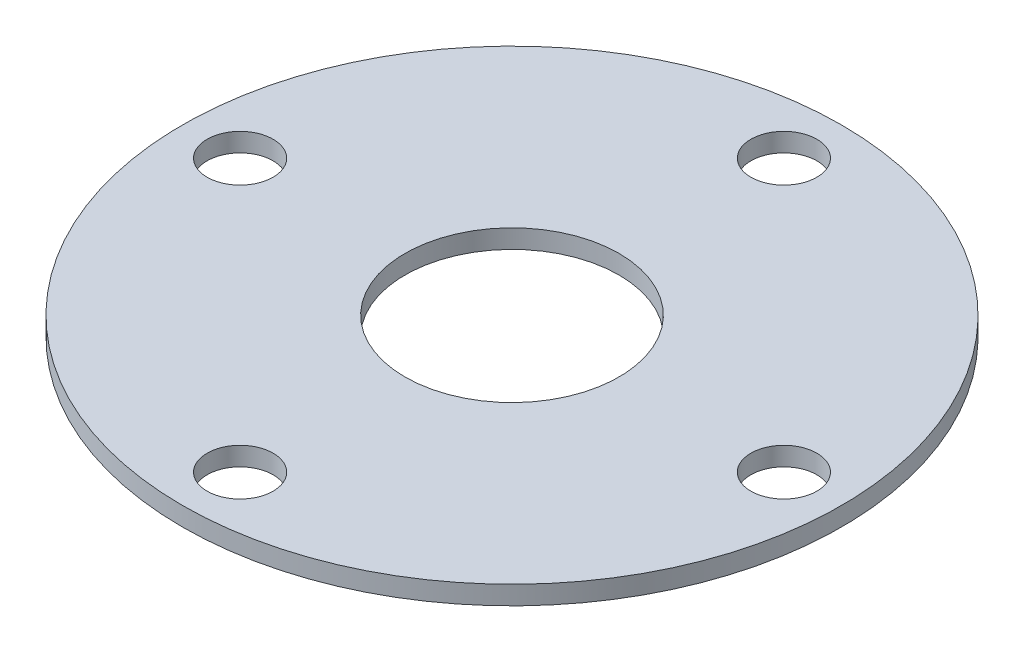
ISO-10303-21;
HEADER;
FILE_DESCRIPTION(('STEP AP214'),'2;1');
FILE_NAME('part.step','',(''),(''),'','','');
FILE_SCHEMA(('AUTOMOTIVE_DESIGN { 1 0 10303 214 1 1 1 1 }'));
ENDSEC;
DATA;
#1=APPLICATION_CONTEXT('core data for automotive mechanical design processes');
#2=APPLICATION_PROTOCOL_DEFINITION('international standard','automotive_design',2000,#1);
#3=PRODUCT_CONTEXT('',#1,'mechanical');
#4=PRODUCT('Part','Part','',(#3));
#5=PRODUCT_RELATED_PRODUCT_CATEGORY('part','',(#4));
#6=PRODUCT_DEFINITION_FORMATION('','',#4);
#7=PRODUCT_DEFINITION_CONTEXT('part definition',#1,'design');
#8=PRODUCT_DEFINITION('design','',#6,#7);
#9=PRODUCT_DEFINITION_SHAPE('','',#8);
#10=(LENGTH_UNIT() NAMED_UNIT(*) SI_UNIT(.MILLI.,.METRE.));
#11=(NAMED_UNIT(*) PLANE_ANGLE_UNIT() SI_UNIT($,.RADIAN.));
#12=(NAMED_UNIT(*) SI_UNIT($,.STERADIAN.) SOLID_ANGLE_UNIT());
#13=UNCERTAINTY_MEASURE_WITH_UNIT(LENGTH_MEASURE(1.E-05),#10,'distance_accuracy_value','');
#14=(GEOMETRIC_REPRESENTATION_CONTEXT(3) GLOBAL_UNCERTAINTY_ASSIGNED_CONTEXT((#13)) GLOBAL_UNIT_ASSIGNED_CONTEXT((#10,
#11,#12)) REPRESENTATION_CONTEXT('',''));
#15=CARTESIAN_POINT('',(0.,0.,0.));
#16=DIRECTION('',(0.,0.,1.));
#17=DIRECTION('',(1.,0.,0.));
#18=AXIS2_PLACEMENT_3D('',#15,#16,#17);
#19=CARTESIAN_POINT('',(0.,1.8034,0.));
#20=DIRECTION('',(0.,1.,0.));
#21=DIRECTION('',(0.,0.,1.));
#22=AXIS2_PLACEMENT_3D('',#19,#20,#21);
#23=PLANE('',#22);
#24=CARTESIAN_POINT('',(1.82909978638645E-13,1.8034,-26.19375));
#25=DIRECTION('',(0.,1.,0.));
#26=DIRECTION('',(0.,0.,1.));
#27=AXIS2_PLACEMENT_3D('',#24,#25,#26);
#28=CIRCLE('',#27,3.175);
#29=CARTESIAN_POINT('',(1.82909978638645E-13,1.8034,-23.01875));
#30=VERTEX_POINT('',#29);
#31=EDGE_CURVE('E60',#30,#30,#28,.T.);
#32=ORIENTED_EDGE('',*,*,#31,.F.);
#33=EDGE_LOOP('',(#32));
#34=FACE_BOUND('',#33,.T.);
#35=CARTESIAN_POINT('',(0.,1.8034,26.19375));
#36=DIRECTION('',(0.,1.,0.));
#37=DIRECTION('',(0.,0.,1.));
#38=AXIS2_PLACEMENT_3D('',#35,#36,#37);
#39=CIRCLE('',#38,3.175);
#40=CARTESIAN_POINT('',(0.,1.8034,29.36875));
#41=VERTEX_POINT('',#40);
#42=EDGE_CURVE('E48',#41,#41,#39,.T.);
#43=ORIENTED_EDGE('',*,*,#42,.F.);
#44=EDGE_LOOP('',(#43));
#45=FACE_BOUND('',#44,.T.);
#46=CARTESIAN_POINT('',(0.,1.8034,0.));
#47=DIRECTION('',(0.,1.,0.));
#48=DIRECTION('',(0.,0.,1.));
#49=AXIS2_PLACEMENT_3D('',#46,#47,#48);
#50=CIRCLE('',#49,31.75);
#51=CARTESIAN_POINT('',(0.,1.8034,31.75));
#52=VERTEX_POINT('',#51);
#53=EDGE_CURVE('E10',#52,#52,#50,.T.);
#54=ORIENTED_EDGE('',*,*,#53,.T.);
#55=EDGE_LOOP('',(#54));
#56=FACE_BOUND('',#55,.T.);
#57=CARTESIAN_POINT('',(0.,1.8034,0.));
#58=DIRECTION('',(0.,1.,0.));
#59=DIRECTION('',(0.,0.,1.));
#60=AXIS2_PLACEMENT_3D('',#57,#58,#59);
#61=CIRCLE('',#60,10.3124);
#62=CARTESIAN_POINT('',(0.,1.8034,10.3124));
#63=VERTEX_POINT('',#62);
#64=EDGE_CURVE('E43',#63,#63,#61,.T.);
#65=ORIENTED_EDGE('',*,*,#64,.F.);
#66=EDGE_LOOP('',(#65));
#67=FACE_BOUND('',#66,.T.);
#68=CARTESIAN_POINT('',(-26.19375,1.8034,0.));
#69=DIRECTION('',(0.,1.,0.));
#70=DIRECTION('',(0.,0.,1.));
#71=AXIS2_PLACEMENT_3D('',#68,#69,#70);
#72=CIRCLE('',#71,3.175);
#73=CARTESIAN_POINT('',(-26.19375,1.8034,3.17499999999991));
#74=VERTEX_POINT('',#73);
#75=EDGE_CURVE('E54',#74,#74,#72,.T.);
#76=ORIENTED_EDGE('',*,*,#75,.F.);
#77=EDGE_LOOP('',(#76));
#78=FACE_BOUND('',#77,.T.);
#79=CARTESIAN_POINT('',(26.19375,1.8034,2.74364967957967E-13));
#80=DIRECTION('',(0.,1.,0.));
#81=DIRECTION('',(0.,0.,1.));
#82=AXIS2_PLACEMENT_3D('',#79,#80,#81);
#83=CIRCLE('',#82,3.175);
#84=CARTESIAN_POINT('',(26.19375,1.8034,3.17500000000028));
#85=VERTEX_POINT('',#84);
#86=EDGE_CURVE('E66',#85,#85,#83,.T.);
#87=ORIENTED_EDGE('',*,*,#86,.F.);
#88=EDGE_LOOP('',(#87));
#89=FACE_BOUND('',#88,.T.);
#90=ADVANCED_FACE('F32',(#34,#45,#56,#67,#78,#89),#23,.T.);
#91=CARTESIAN_POINT('',(0.,0.,0.));
#92=DIRECTION('',(0.,1.,0.));
#93=DIRECTION('',(0.,0.,1.));
#94=AXIS2_PLACEMENT_3D('',#91,#92,#93);
#95=PLANE('',#94);
#96=CARTESIAN_POINT('',(0.,0.,0.));
#97=DIRECTION('',(0.,1.,0.));
#98=DIRECTION('',(0.,0.,1.));
#99=AXIS2_PLACEMENT_3D('',#96,#97,#98);
#100=CIRCLE('',#99,31.75);
#101=CARTESIAN_POINT('',(0.,0.,31.75));
#102=VERTEX_POINT('',#101);
#103=EDGE_CURVE('E36',#102,#102,#100,.T.);
#104=ORIENTED_EDGE('',*,*,#103,.F.);
#105=EDGE_LOOP('',(#104));
#106=FACE_BOUND('',#105,.T.);
#107=CARTESIAN_POINT('',(0.,0.,0.));
#108=DIRECTION('',(0.,1.,0.));
#109=DIRECTION('',(0.,0.,1.));
#110=AXIS2_PLACEMENT_3D('',#107,#108,#109);
#111=CIRCLE('',#110,10.3124);
#112=CARTESIAN_POINT('',(0.,0.,10.3124));
#113=VERTEX_POINT('',#112);
#114=EDGE_CURVE('E45',#113,#113,#111,.T.);
#115=ORIENTED_EDGE('',*,*,#114,.T.);
#116=EDGE_LOOP('',(#115));
#117=FACE_BOUND('',#116,.T.);
#118=CARTESIAN_POINT('',(0.,0.,26.19375));
#119=DIRECTION('',(0.,1.,0.));
#120=DIRECTION('',(0.,0.,1.));
#121=AXIS2_PLACEMENT_3D('',#118,#119,#120);
#122=CIRCLE('',#121,3.175);
#123=CARTESIAN_POINT('',(0.,0.,29.36875));
#124=VERTEX_POINT('',#123);
#125=EDGE_CURVE('E51',#124,#124,#122,.T.);
#126=ORIENTED_EDGE('',*,*,#125,.T.);
#127=EDGE_LOOP('',(#126));
#128=FACE_BOUND('',#127,.T.);
#129=CARTESIAN_POINT('',(-26.19375,0.,0.));
#130=DIRECTION('',(0.,1.,0.));
#131=DIRECTION('',(0.,0.,1.));
#132=AXIS2_PLACEMENT_3D('',#129,#130,#131);
#133=CIRCLE('',#132,3.175);
#134=CARTESIAN_POINT('',(-26.19375,0.,3.17499999999991));
#135=VERTEX_POINT('',#134);
#136=EDGE_CURVE('E57',#135,#135,#133,.T.);
#137=ORIENTED_EDGE('',*,*,#136,.T.);
#138=EDGE_LOOP('',(#137));
#139=FACE_BOUND('',#138,.T.);
#140=CARTESIAN_POINT('',(1.82909978638645E-13,0.,-26.19375));
#141=DIRECTION('',(0.,1.,0.));
#142=DIRECTION('',(0.,0.,1.));
#143=AXIS2_PLACEMENT_3D('',#140,#141,#142);
#144=CIRCLE('',#143,3.175);
#145=CARTESIAN_POINT('',(1.82909978638645E-13,0.,-23.01875));
#146=VERTEX_POINT('',#145);
#147=EDGE_CURVE('E63',#146,#146,#144,.T.);
#148=ORIENTED_EDGE('',*,*,#147,.T.);
#149=EDGE_LOOP('',(#148));
#150=FACE_BOUND('',#149,.T.);
#151=CARTESIAN_POINT('',(26.19375,0.,2.74364967957967E-13));
#152=DIRECTION('',(0.,1.,0.));
#153=DIRECTION('',(0.,0.,1.));
#154=AXIS2_PLACEMENT_3D('',#151,#152,#153);
#155=CIRCLE('',#154,3.175);
#156=CARTESIAN_POINT('',(26.19375,0.,3.17500000000028));
#157=VERTEX_POINT('',#156);
#158=EDGE_CURVE('E69',#157,#157,#155,.T.);
#159=ORIENTED_EDGE('',*,*,#158,.T.);
#160=EDGE_LOOP('',(#159));
#161=FACE_BOUND('',#160,.T.);
#162=ADVANCED_FACE('F79',(#106,#117,#128,#139,#150,#161),#95,.F.);
#163=CARTESIAN_POINT('',(0.,1.8034,0.));
#164=DIRECTION('',(0.,-1.,0.));
#165=DIRECTION('',(0.,0.,-1.));
#166=AXIS2_PLACEMENT_3D('',#163,#164,#165);
#167=CYLINDRICAL_SURFACE('',#166,31.75);
#168=ORIENTED_EDGE('',*,*,#53,.F.);
#169=EDGE_LOOP('',(#168));
#170=FACE_BOUND('',#169,.T.);
#171=ORIENTED_EDGE('',*,*,#103,.T.);
#172=EDGE_LOOP('',(#171));
#173=FACE_BOUND('',#172,.T.);
#174=ADVANCED_FACE('F34',(#170,#173),#167,.T.);
#175=CARTESIAN_POINT('',(0.,1.8034,0.));
#176=DIRECTION('',(0.,-1.,0.));
#177=DIRECTION('',(0.,0.,-1.));
#178=AXIS2_PLACEMENT_3D('',#175,#176,#177);
#179=CYLINDRICAL_SURFACE('',#178,10.3124);
#180=ORIENTED_EDGE('',*,*,#64,.T.);
#181=EDGE_LOOP('',(#180));
#182=FACE_BOUND('',#181,.T.);
#183=ORIENTED_EDGE('',*,*,#114,.F.);
#184=EDGE_LOOP('',(#183));
#185=FACE_BOUND('',#184,.T.);
#186=ADVANCED_FACE('F89',(#182,#185),#179,.F.);
#187=CARTESIAN_POINT('',(0.,1.8034,26.19375));
#188=DIRECTION('',(0.,-1.,0.));
#189=DIRECTION('',(0.,0.,-1.));
#190=AXIS2_PLACEMENT_3D('',#187,#188,#189);
#191=CYLINDRICAL_SURFACE('',#190,3.175);
#192=ORIENTED_EDGE('',*,*,#42,.T.);
#193=EDGE_LOOP('',(#192));
#194=FACE_BOUND('',#193,.T.);
#195=ORIENTED_EDGE('',*,*,#125,.F.);
#196=EDGE_LOOP('',(#195));
#197=FACE_BOUND('',#196,.T.);
#198=ADVANCED_FACE('F92',(#194,#197),#191,.F.);
#199=CARTESIAN_POINT('',(-26.19375,1.8034,0.));
#200=DIRECTION('',(0.,-1.,0.));
#201=DIRECTION('',(0.,0.,-1.));
#202=AXIS2_PLACEMENT_3D('',#199,#200,#201);
#203=CYLINDRICAL_SURFACE('',#202,3.175);
#204=ORIENTED_EDGE('',*,*,#75,.T.);
#205=EDGE_LOOP('',(#204));
#206=FACE_BOUND('',#205,.T.);
#207=ORIENTED_EDGE('',*,*,#136,.F.);
#208=EDGE_LOOP('',(#207));
#209=FACE_BOUND('',#208,.T.);
#210=ADVANCED_FACE('F96',(#206,#209),#203,.F.);
#211=CARTESIAN_POINT('',(1.82909978638645E-13,1.8034,-26.19375));
#212=DIRECTION('',(0.,-1.,0.));
#213=DIRECTION('',(0.,0.,-1.));
#214=AXIS2_PLACEMENT_3D('',#211,#212,#213);
#215=CYLINDRICAL_SURFACE('',#214,3.175);
#216=ORIENTED_EDGE('',*,*,#31,.T.);
#217=EDGE_LOOP('',(#216));
#218=FACE_BOUND('',#217,.T.);
#219=ORIENTED_EDGE('',*,*,#147,.F.);
#220=EDGE_LOOP('',(#219));
#221=FACE_BOUND('',#220,.T.);
#222=ADVANCED_FACE('F100',(#218,#221),#215,.F.);
#223=CARTESIAN_POINT('',(26.19375,1.8034,2.74364967957967E-13));
#224=DIRECTION('',(0.,-1.,0.));
#225=DIRECTION('',(0.,0.,-1.));
#226=AXIS2_PLACEMENT_3D('',#223,#224,#225);
#227=CYLINDRICAL_SURFACE('',#226,3.175);
#228=ORIENTED_EDGE('',*,*,#86,.T.);
#229=EDGE_LOOP('',(#228));
#230=FACE_BOUND('',#229,.T.);
#231=ORIENTED_EDGE('',*,*,#158,.F.);
#232=EDGE_LOOP('',(#231));
#233=FACE_BOUND('',#232,.T.);
#234=ADVANCED_FACE('F75',(#230,#233),#227,.F.);
#235=CLOSED_SHELL('',(#90,#162,#174,#186,#198,#210,#222,#234));
#236=MANIFOLD_SOLID_BREP('B2',#235);
#237=ADVANCED_BREP_SHAPE_REPRESENTATION('',(#18,#236),#14);
#238=SHAPE_DEFINITION_REPRESENTATION(#9,#237);
ENDSEC;
END-ISO-10303-21;
